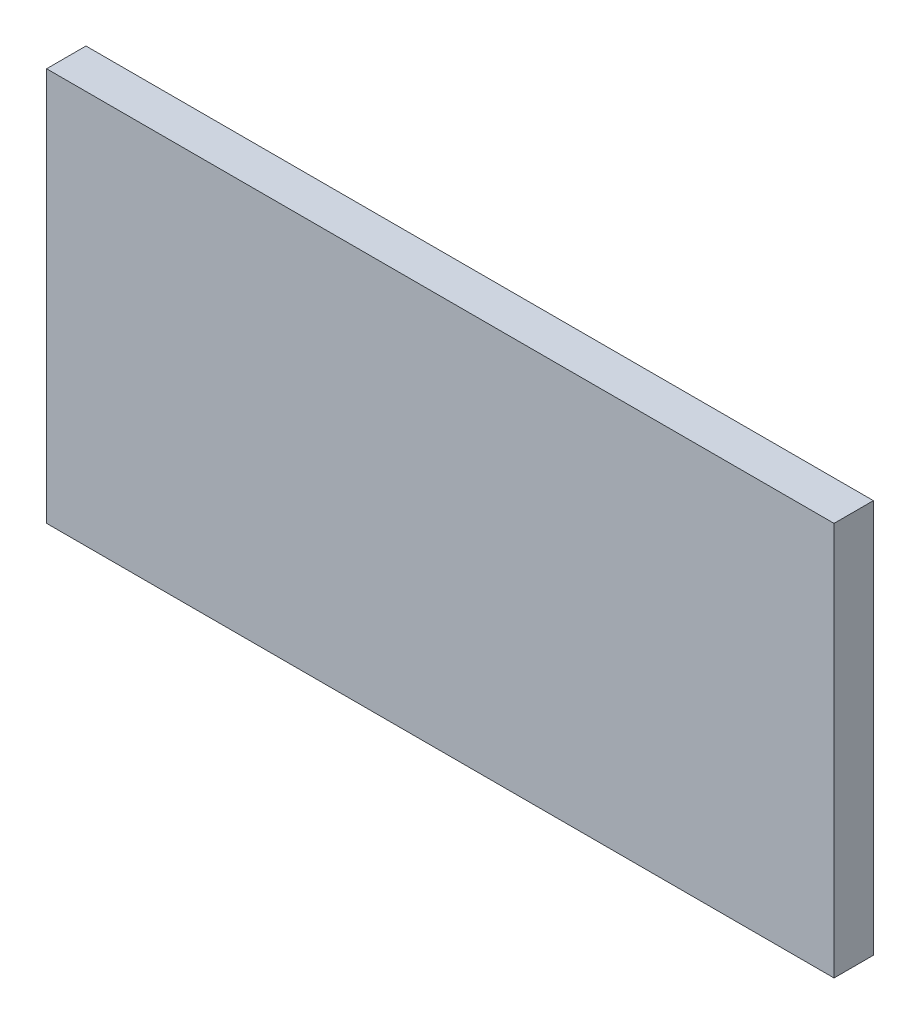
ISO-10303-21;
HEADER;
FILE_DESCRIPTION(('STEP AP214'),'2;1');
FILE_NAME('part.step','',(''),(''),'','','');
FILE_SCHEMA(('AUTOMOTIVE_DESIGN { 1 0 10303 214 1 1 1 1 }'));
ENDSEC;
DATA;
#1=APPLICATION_CONTEXT('core data for automotive mechanical design processes');
#2=APPLICATION_PROTOCOL_DEFINITION('international standard','automotive_design',2000,#1);
#3=PRODUCT_CONTEXT('',#1,'mechanical');
#4=PRODUCT('Part','Part','',(#3));
#5=PRODUCT_RELATED_PRODUCT_CATEGORY('part','',(#4));
#6=PRODUCT_DEFINITION_FORMATION('','',#4);
#7=PRODUCT_DEFINITION_CONTEXT('part definition',#1,'design');
#8=PRODUCT_DEFINITION('design','',#6,#7);
#9=PRODUCT_DEFINITION_SHAPE('','',#8);
#10=(LENGTH_UNIT() NAMED_UNIT(*) SI_UNIT(.MILLI.,.METRE.));
#11=(NAMED_UNIT(*) PLANE_ANGLE_UNIT() SI_UNIT($,.RADIAN.));
#12=(NAMED_UNIT(*) SI_UNIT($,.STERADIAN.) SOLID_ANGLE_UNIT());
#13=UNCERTAINTY_MEASURE_WITH_UNIT(LENGTH_MEASURE(1.E-05),#10,'distance_accuracy_value','');
#14=(GEOMETRIC_REPRESENTATION_CONTEXT(3) GLOBAL_UNCERTAINTY_ASSIGNED_CONTEXT((#13)) GLOBAL_UNIT_ASSIGNED_CONTEXT((#10,
#11,#12)) REPRESENTATION_CONTEXT('',''));
#15=CARTESIAN_POINT('',(0.,0.,0.));
#16=DIRECTION('',(0.,0.,1.));
#17=DIRECTION('',(1.,0.,0.));
#18=AXIS2_PLACEMENT_3D('',#15,#16,#17);
#19=CARTESIAN_POINT('',(30.,15.,3.));
#20=DIRECTION('',(-1.,0.,0.));
#21=DIRECTION('',(0.,0.,1.));
#22=AXIS2_PLACEMENT_3D('',#19,#20,#21);
#23=PLANE('',#22);
#24=DIRECTION('',(0.,1.,0.));
#25=VECTOR('',#24,1.);
#26=CARTESIAN_POINT('',(30.,15.,0.));
#27=LINE('',#26,#25);
#28=CARTESIAN_POINT('',(30.,-15.,0.));
#29=VERTEX_POINT('',#28);
#30=CARTESIAN_POINT('',(30.,15.,0.));
#31=VERTEX_POINT('',#30);
#32=EDGE_CURVE('E107',#29,#31,#27,.T.);
#33=ORIENTED_EDGE('',*,*,#32,.T.);
#34=DIRECTION('',(0.,0.,-1.));
#35=VECTOR('',#34,1.);
#36=CARTESIAN_POINT('',(30.,15.,3.));
#37=LINE('',#36,#35);
#38=CARTESIAN_POINT('',(30.,15.,3.));
#39=VERTEX_POINT('',#38);
#40=EDGE_CURVE('E11',#39,#31,#37,.T.);
#41=ORIENTED_EDGE('',*,*,#40,.F.);
#42=DIRECTION('',(0.,1.,0.));
#43=VECTOR('',#42,1.);
#44=CARTESIAN_POINT('',(30.,15.,3.));
#45=LINE('',#44,#43);
#46=CARTESIAN_POINT('',(30.,-15.,3.));
#47=VERTEX_POINT('',#46);
#48=EDGE_CURVE('E91',#47,#39,#45,.T.);
#49=ORIENTED_EDGE('',*,*,#48,.F.);
#50=DIRECTION('',(0.,0.,-1.));
#51=VECTOR('',#50,1.);
#52=CARTESIAN_POINT('',(30.,-15.,3.));
#53=LINE('',#52,#51);
#54=EDGE_CURVE('E103',#47,#29,#53,.T.);
#55=ORIENTED_EDGE('',*,*,#54,.T.);
#56=EDGE_LOOP('',(#33,#41,#49,#55));
#57=FACE_BOUND('',#56,.T.);
#58=ADVANCED_FACE('F39',(#57),#23,.F.);
#59=CARTESIAN_POINT('',(-30.,15.,3.));
#60=DIRECTION('',(0.,-1.,0.));
#61=DIRECTION('',(0.,0.,-1.));
#62=AXIS2_PLACEMENT_3D('',#59,#60,#61);
#63=PLANE('',#62);
#64=DIRECTION('',(-1.,0.,0.));
#65=VECTOR('',#64,1.);
#66=CARTESIAN_POINT('',(-30.,15.,0.));
#67=LINE('',#66,#65);
#68=CARTESIAN_POINT('',(-30.,15.,0.));
#69=VERTEX_POINT('',#68);
#70=EDGE_CURVE('E96',#31,#69,#67,.T.);
#71=ORIENTED_EDGE('',*,*,#70,.T.);
#72=DIRECTION('',(0.,0.,-1.));
#73=VECTOR('',#72,1.);
#74=CARTESIAN_POINT('',(-30.,15.,3.));
#75=LINE('',#74,#73);
#76=CARTESIAN_POINT('',(-30.,15.,3.));
#77=VERTEX_POINT('',#76);
#78=EDGE_CURVE('E48',#77,#69,#75,.T.);
#79=ORIENTED_EDGE('',*,*,#78,.F.);
#80=DIRECTION('',(-1.,0.,0.));
#81=VECTOR('',#80,1.);
#82=CARTESIAN_POINT('',(-30.,15.,3.));
#83=LINE('',#82,#81);
#84=EDGE_CURVE('E86',#39,#77,#83,.T.);
#85=ORIENTED_EDGE('',*,*,#84,.F.);
#86=ORIENTED_EDGE('',*,*,#40,.T.);
#87=EDGE_LOOP('',(#71,#79,#85,#86));
#88=FACE_BOUND('',#87,.T.);
#89=ADVANCED_FACE('F95',(#88),#63,.F.);
#90=CARTESIAN_POINT('',(-30.,15.,3.));
#91=DIRECTION('',(1.,0.,0.));
#92=DIRECTION('',(0.,0.,-1.));
#93=AXIS2_PLACEMENT_3D('',#90,#91,#92);
#94=PLANE('',#93);
#95=DIRECTION('',(0.,-1.,0.));
#96=VECTOR('',#95,1.);
#97=CARTESIAN_POINT('',(-30.,15.,0.));
#98=LINE('',#97,#96);
#99=CARTESIAN_POINT('',(-30.,-15.,0.));
#100=VERTEX_POINT('',#99);
#101=EDGE_CURVE('E73',#69,#100,#98,.T.);
#102=ORIENTED_EDGE('',*,*,#101,.T.);
#103=DIRECTION('',(0.,0.,-1.));
#104=VECTOR('',#103,1.);
#105=CARTESIAN_POINT('',(-30.,-15.,3.));
#106=LINE('',#105,#104);
#107=CARTESIAN_POINT('',(-30.,-15.,3.));
#108=VERTEX_POINT('',#107);
#109=EDGE_CURVE('E98',#108,#100,#106,.T.);
#110=ORIENTED_EDGE('',*,*,#109,.F.);
#111=DIRECTION('',(0.,-1.,0.));
#112=VECTOR('',#111,1.);
#113=CARTESIAN_POINT('',(-30.,15.,3.));
#114=LINE('',#113,#112);
#115=EDGE_CURVE('E89',#77,#108,#114,.T.);
#116=ORIENTED_EDGE('',*,*,#115,.F.);
#117=ORIENTED_EDGE('',*,*,#78,.T.);
#118=EDGE_LOOP('',(#102,#110,#116,#117));
#119=FACE_BOUND('',#118,.T.);
#120=ADVANCED_FACE('F99',(#119),#94,.F.);
#121=CARTESIAN_POINT('',(-30.,-15.,3.));
#122=DIRECTION('',(0.,1.,0.));
#123=DIRECTION('',(0.,0.,1.));
#124=AXIS2_PLACEMENT_3D('',#121,#122,#123);
#125=PLANE('',#124);
#126=DIRECTION('',(1.,0.,0.));
#127=VECTOR('',#126,1.);
#128=CARTESIAN_POINT('',(-30.,-15.,0.));
#129=LINE('',#128,#127);
#130=EDGE_CURVE('E79',#100,#29,#129,.T.);
#131=ORIENTED_EDGE('',*,*,#130,.T.);
#132=ORIENTED_EDGE('',*,*,#54,.F.);
#133=DIRECTION('',(1.,0.,0.));
#134=VECTOR('',#133,1.);
#135=CARTESIAN_POINT('',(-30.,-15.,3.));
#136=LINE('',#135,#134);
#137=EDGE_CURVE('E56',#108,#47,#136,.T.);
#138=ORIENTED_EDGE('',*,*,#137,.F.);
#139=ORIENTED_EDGE('',*,*,#109,.T.);
#140=EDGE_LOOP('',(#131,#132,#138,#139));
#141=FACE_BOUND('',#140,.T.);
#142=ADVANCED_FACE('F120',(#141),#125,.F.);
#143=CARTESIAN_POINT('',(0.,0.,3.));
#144=DIRECTION('',(0.,0.,1.));
#145=DIRECTION('',(1.,0.,0.));
#146=AXIS2_PLACEMENT_3D('',#143,#144,#145);
#147=PLANE('',#146);
#148=ORIENTED_EDGE('',*,*,#48,.T.);
#149=ORIENTED_EDGE('',*,*,#84,.T.);
#150=ORIENTED_EDGE('',*,*,#115,.T.);
#151=ORIENTED_EDGE('',*,*,#137,.T.);
#152=EDGE_LOOP('',(#148,#149,#150,#151));
#153=FACE_BOUND('',#152,.T.);
#154=ADVANCED_FACE('F87',(#153),#147,.T.);
#155=CARTESIAN_POINT('',(0.,0.,0.));
#156=DIRECTION('',(0.,0.,1.));
#157=DIRECTION('',(1.,0.,0.));
#158=AXIS2_PLACEMENT_3D('',#155,#156,#157);
#159=PLANE('',#158);
#160=ORIENTED_EDGE('',*,*,#32,.F.);
#161=ORIENTED_EDGE('',*,*,#130,.F.);
#162=ORIENTED_EDGE('',*,*,#101,.F.);
#163=ORIENTED_EDGE('',*,*,#70,.F.);
#164=EDGE_LOOP('',(#160,#161,#162,#163));
#165=FACE_BOUND('',#164,.T.);
#166=ADVANCED_FACE('F123',(#165),#159,.F.);
#167=CLOSED_SHELL('',(#58,#89,#120,#142,#154,#166));
#168=MANIFOLD_SOLID_BREP('B2',#167);
#169=ADVANCED_BREP_SHAPE_REPRESENTATION('',(#18,#168),#14);
#170=SHAPE_DEFINITION_REPRESENTATION(#9,#169);
ENDSEC;
END-ISO-10303-21;
